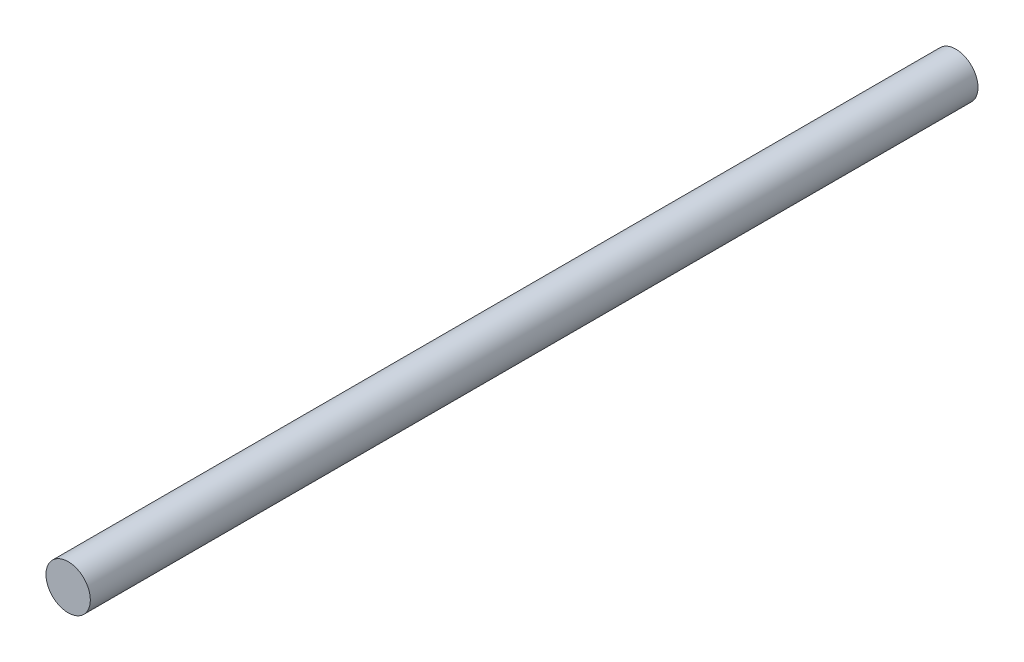
ISO-10303-21;
HEADER;
FILE_DESCRIPTION(('STEP AP214'),'2;1');
FILE_NAME('part.step','',(''),(''),'','','');
FILE_SCHEMA(('AUTOMOTIVE_DESIGN { 1 0 10303 214 1 1 1 1 }'));
ENDSEC;
DATA;
#1=APPLICATION_CONTEXT('core data for automotive mechanical design processes');
#2=APPLICATION_PROTOCOL_DEFINITION('international standard','automotive_design',2000,#1);
#3=PRODUCT_CONTEXT('',#1,'mechanical');
#4=PRODUCT('Part','Part','',(#3));
#5=PRODUCT_RELATED_PRODUCT_CATEGORY('part','',(#4));
#6=PRODUCT_DEFINITION_FORMATION('','',#4);
#7=PRODUCT_DEFINITION_CONTEXT('part definition',#1,'design');
#8=PRODUCT_DEFINITION('design','',#6,#7);
#9=PRODUCT_DEFINITION_SHAPE('','',#8);
#10=(LENGTH_UNIT() NAMED_UNIT(*) SI_UNIT(.MILLI.,.METRE.));
#11=(NAMED_UNIT(*) PLANE_ANGLE_UNIT() SI_UNIT($,.RADIAN.));
#12=(NAMED_UNIT(*) SI_UNIT($,.STERADIAN.) SOLID_ANGLE_UNIT());
#13=UNCERTAINTY_MEASURE_WITH_UNIT(LENGTH_MEASURE(1.E-05),#10,'distance_accuracy_value','');
#14=(GEOMETRIC_REPRESENTATION_CONTEXT(3) GLOBAL_UNCERTAINTY_ASSIGNED_CONTEXT((#13)) GLOBAL_UNIT_ASSIGNED_CONTEXT((#10,
#11,#12)) REPRESENTATION_CONTEXT('',''));
#15=CARTESIAN_POINT('',(0.,0.,0.));
#16=DIRECTION('',(0.,0.,1.));
#17=DIRECTION('',(1.,0.,0.));
#18=AXIS2_PLACEMENT_3D('',#15,#16,#17);
#19=CARTESIAN_POINT('',(0.,0.,400.));
#20=DIRECTION('',(0.,0.,-1.));
#21=DIRECTION('',(-1.,0.,0.));
#22=AXIS2_PLACEMENT_3D('',#19,#20,#21);
#23=CYLINDRICAL_SURFACE('',#22,10.);
#24=CARTESIAN_POINT('',(0.,0.,400.));
#25=DIRECTION('',(0.,0.,1.));
#26=DIRECTION('',(1.,0.,0.));
#27=AXIS2_PLACEMENT_3D('',#24,#25,#26);
#28=CIRCLE('',#27,10.);
#29=CARTESIAN_POINT('',(10.,0.,400.));
#30=VERTEX_POINT('',#29);
#31=EDGE_CURVE('E10',#30,#30,#28,.T.);
#32=ORIENTED_EDGE('',*,*,#31,.F.);
#33=EDGE_LOOP('',(#32));
#34=FACE_BOUND('',#33,.T.);
#35=CARTESIAN_POINT('',(0.,0.,0.));
#36=DIRECTION('',(0.,0.,1.));
#37=DIRECTION('',(1.,0.,0.));
#38=AXIS2_PLACEMENT_3D('',#35,#36,#37);
#39=CIRCLE('',#38,10.);
#40=CARTESIAN_POINT('',(10.,0.,0.));
#41=VERTEX_POINT('',#40);
#42=EDGE_CURVE('E34',#41,#41,#39,.T.);
#43=ORIENTED_EDGE('',*,*,#42,.T.);
#44=EDGE_LOOP('',(#43));
#45=FACE_BOUND('',#44,.T.);
#46=ADVANCED_FACE('F31',(#34,#45),#23,.T.);
#47=CARTESIAN_POINT('',(0.,0.,400.));
#48=DIRECTION('',(0.,0.,1.));
#49=DIRECTION('',(1.,0.,0.));
#50=AXIS2_PLACEMENT_3D('',#47,#48,#49);
#51=PLANE('',#50);
#52=ORIENTED_EDGE('',*,*,#31,.T.);
#53=EDGE_LOOP('',(#52));
#54=FACE_BOUND('',#53,.T.);
#55=ADVANCED_FACE('F46',(#54),#51,.T.);
#56=CARTESIAN_POINT('',(0.,0.,0.));
#57=DIRECTION('',(0.,0.,1.));
#58=DIRECTION('',(1.,0.,0.));
#59=AXIS2_PLACEMENT_3D('',#56,#57,#58);
#60=PLANE('',#59);
#61=ORIENTED_EDGE('',*,*,#42,.F.);
#62=EDGE_LOOP('',(#61));
#63=FACE_BOUND('',#62,.T.);
#64=ADVANCED_FACE('F44',(#63),#60,.F.);
#65=CLOSED_SHELL('',(#46,#55,#64));
#66=MANIFOLD_SOLID_BREP('B2',#65);
#67=ADVANCED_BREP_SHAPE_REPRESENTATION('',(#18,#66),#14);
#68=SHAPE_DEFINITION_REPRESENTATION(#9,#67);
ENDSEC;
END-ISO-10303-21;
